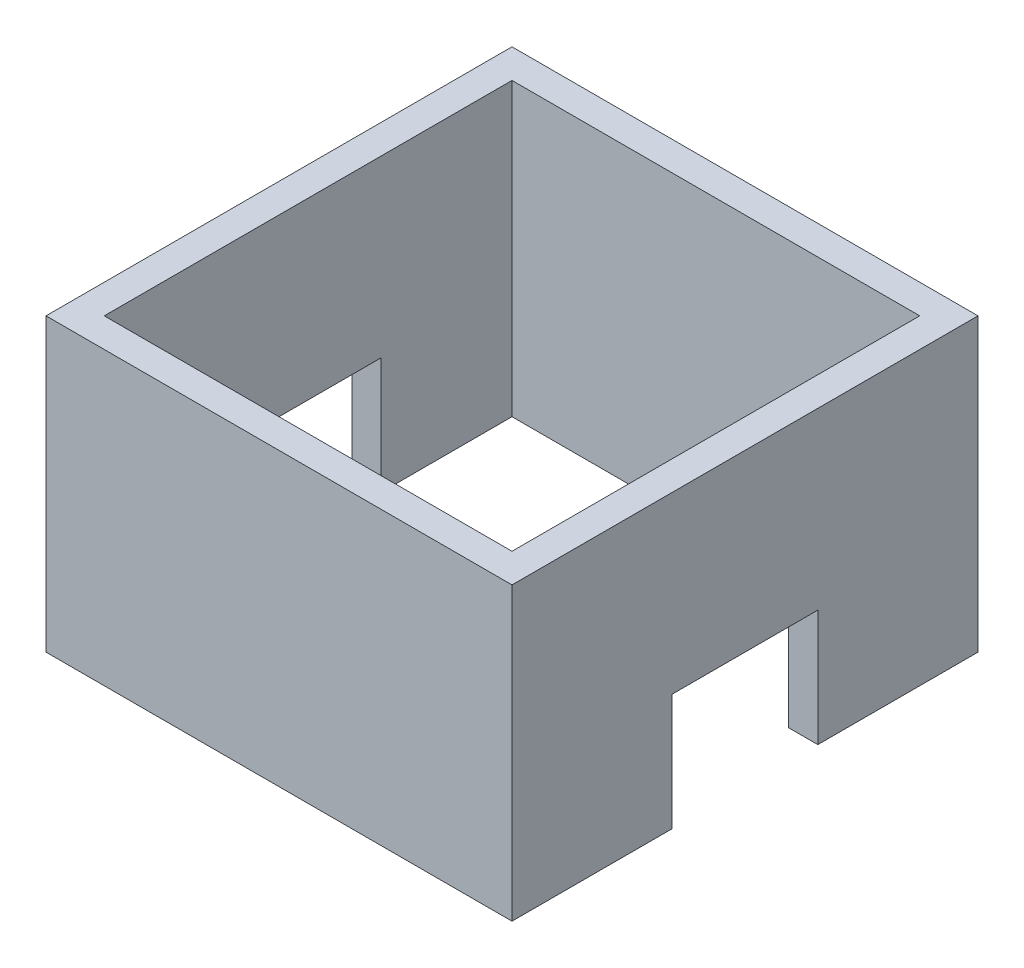
ISO-10303-21;
HEADER;
FILE_DESCRIPTION(('STEP AP214'),'2;1');
FILE_NAME('part.step','',(''),(''),'','','');
FILE_SCHEMA(('AUTOMOTIVE_DESIGN { 1 0 10303 214 1 1 1 1 }'));
ENDSEC;
DATA;
#1=APPLICATION_CONTEXT('core data for automotive mechanical design processes');
#2=APPLICATION_PROTOCOL_DEFINITION('international standard','automotive_design',2000,#1);
#3=PRODUCT_CONTEXT('',#1,'mechanical');
#4=PRODUCT('Part','Part','',(#3));
#5=PRODUCT_RELATED_PRODUCT_CATEGORY('part','',(#4));
#6=PRODUCT_DEFINITION_FORMATION('','',#4);
#7=PRODUCT_DEFINITION_CONTEXT('part definition',#1,'design');
#8=PRODUCT_DEFINITION('design','',#6,#7);
#9=PRODUCT_DEFINITION_SHAPE('','',#8);
#10=(LENGTH_UNIT() NAMED_UNIT(*) SI_UNIT(.MILLI.,.METRE.));
#11=(NAMED_UNIT(*) PLANE_ANGLE_UNIT() SI_UNIT($,.RADIAN.));
#12=(NAMED_UNIT(*) SI_UNIT($,.STERADIAN.) SOLID_ANGLE_UNIT());
#13=UNCERTAINTY_MEASURE_WITH_UNIT(LENGTH_MEASURE(1.E-05),#10,'distance_accuracy_value','');
#14=(GEOMETRIC_REPRESENTATION_CONTEXT(3) GLOBAL_UNCERTAINTY_ASSIGNED_CONTEXT((#13)) GLOBAL_UNIT_ASSIGNED_CONTEXT((#10,
#11,#12)) REPRESENTATION_CONTEXT('',''));
#15=CARTESIAN_POINT('',(0.,0.,0.));
#16=DIRECTION('',(0.,0.,1.));
#17=DIRECTION('',(1.,0.,0.));
#18=AXIS2_PLACEMENT_3D('',#15,#16,#17);
#19=CARTESIAN_POINT('',(0.,0.,0.));
#20=DIRECTION('',(0.,-1.,0.));
#21=DIRECTION('',(0.,0.,-1.));
#22=AXIS2_PLACEMENT_3D('',#19,#20,#21);
#23=PLANE('',#22);
#24=DIRECTION('',(1.,0.,0.));
#25=VECTOR('',#24,1.);
#26=CARTESIAN_POINT('',(-16.,0.,5.));
#27=LINE('',#26,#25);
#28=CARTESIAN_POINT('',(14.,0.,5.));
#29=VERTEX_POINT('',#28);
#30=CARTESIAN_POINT('',(16.,0.,5.));
#31=VERTEX_POINT('',#30);
#32=EDGE_CURVE('E157',#29,#31,#27,.T.);
#33=ORIENTED_EDGE('',*,*,#32,.T.);
#34=DIRECTION('',(0.,0.,-1.));
#35=VECTOR('',#34,1.);
#36=CARTESIAN_POINT('',(16.,0.,16.));
#37=LINE('',#36,#35);
#38=CARTESIAN_POINT('',(16.,0.,16.));
#39=VERTEX_POINT('',#38);
#40=EDGE_CURVE('E179',#39,#31,#37,.T.);
#41=ORIENTED_EDGE('',*,*,#40,.F.);
#42=DIRECTION('',(1.,0.,0.));
#43=VECTOR('',#42,1.);
#44=CARTESIAN_POINT('',(16.,0.,16.));
#45=LINE('',#44,#43);
#46=CARTESIAN_POINT('',(-16.,0.,16.));
#47=VERTEX_POINT('',#46);
#48=EDGE_CURVE('E173',#47,#39,#45,.T.);
#49=ORIENTED_EDGE('',*,*,#48,.F.);
#50=DIRECTION('',(0.,0.,1.));
#51=VECTOR('',#50,1.);
#52=CARTESIAN_POINT('',(-16.,0.,16.));
#53=LINE('',#52,#51);
#54=CARTESIAN_POINT('',(-16.,0.,5.));
#55=VERTEX_POINT('',#54);
#56=EDGE_CURVE('E162',#55,#47,#53,.T.);
#57=ORIENTED_EDGE('',*,*,#56,.F.);
#58=CARTESIAN_POINT('',(-14.,0.,5.));
#59=VERTEX_POINT('',#58);
#60=EDGE_CURVE('E145',#55,#59,#27,.T.);
#61=ORIENTED_EDGE('',*,*,#60,.T.);
#62=DIRECTION('',(0.,0.,1.));
#63=VECTOR('',#62,1.);
#64=CARTESIAN_POINT('',(-14.,0.,14.));
#65=LINE('',#64,#63);
#66=CARTESIAN_POINT('',(-14.,0.,14.));
#67=VERTEX_POINT('',#66);
#68=EDGE_CURVE('E229',#59,#67,#65,.T.);
#69=ORIENTED_EDGE('',*,*,#68,.T.);
#70=DIRECTION('',(1.,0.,0.));
#71=VECTOR('',#70,1.);
#72=CARTESIAN_POINT('',(14.,0.,14.));
#73=LINE('',#72,#71);
#74=CARTESIAN_POINT('',(14.,0.,14.));
#75=VERTEX_POINT('',#74);
#76=EDGE_CURVE('E244',#67,#75,#73,.T.);
#77=ORIENTED_EDGE('',*,*,#76,.T.);
#78=DIRECTION('',(0.,0.,-1.));
#79=VECTOR('',#78,1.);
#80=CARTESIAN_POINT('',(14.,0.,14.));
#81=LINE('',#80,#79);
#82=EDGE_CURVE('E247',#75,#29,#81,.T.);
#83=ORIENTED_EDGE('',*,*,#82,.T.);
#84=EDGE_LOOP('',(#33,#41,#49,#57,#61,#69,#77,#83));
#85=FACE_BOUND('',#84,.T.);
#86=ADVANCED_FACE('F33',(#85),#23,.T.);
#87=CARTESIAN_POINT('',(0.,20.,0.));
#88=DIRECTION('',(0.,-1.,0.));
#89=DIRECTION('',(0.,0.,-1.));
#90=AXIS2_PLACEMENT_3D('',#87,#88,#89);
#91=PLANE('',#90);
#92=DIRECTION('',(1.,0.,0.));
#93=VECTOR('',#92,1.);
#94=CARTESIAN_POINT('',(16.,20.,16.));
#95=LINE('',#94,#93);
#96=CARTESIAN_POINT('',(-16.,20.,16.));
#97=VERTEX_POINT('',#96);
#98=CARTESIAN_POINT('',(16.,20.,16.));
#99=VERTEX_POINT('',#98);
#100=EDGE_CURVE('E178',#97,#99,#95,.T.);
#101=ORIENTED_EDGE('',*,*,#100,.T.);
#102=DIRECTION('',(0.,0.,-1.));
#103=VECTOR('',#102,1.);
#104=CARTESIAN_POINT('',(16.,20.,16.));
#105=LINE('',#104,#103);
#106=CARTESIAN_POINT('',(16.,20.,-16.));
#107=VERTEX_POINT('',#106);
#108=EDGE_CURVE('E262',#99,#107,#105,.T.);
#109=ORIENTED_EDGE('',*,*,#108,.T.);
#110=DIRECTION('',(-1.,0.,0.));
#111=VECTOR('',#110,1.);
#112=CARTESIAN_POINT('',(16.,20.,-16.));
#113=LINE('',#112,#111);
#114=CARTESIAN_POINT('',(-16.,20.,-16.));
#115=VERTEX_POINT('',#114);
#116=EDGE_CURVE('E264',#107,#115,#113,.T.);
#117=ORIENTED_EDGE('',*,*,#116,.T.);
#118=DIRECTION('',(0.,0.,1.));
#119=VECTOR('',#118,1.);
#120=CARTESIAN_POINT('',(-16.,20.,16.));
#121=LINE('',#120,#119);
#122=EDGE_CURVE('E186',#115,#97,#121,.T.);
#123=ORIENTED_EDGE('',*,*,#122,.T.);
#124=EDGE_LOOP('',(#101,#109,#117,#123));
#125=FACE_BOUND('',#124,.T.);
#126=DIRECTION('',(0.,0.,1.));
#127=VECTOR('',#126,1.);
#128=CARTESIAN_POINT('',(-14.,20.,14.));
#129=LINE('',#128,#127);
#130=CARTESIAN_POINT('',(-14.,20.,-14.));
#131=VERTEX_POINT('',#130);
#132=CARTESIAN_POINT('',(-14.,20.,14.));
#133=VERTEX_POINT('',#132);
#134=EDGE_CURVE('E230',#131,#133,#129,.T.);
#135=ORIENTED_EDGE('',*,*,#134,.F.);
#136=DIRECTION('',(-1.,0.,0.));
#137=VECTOR('',#136,1.);
#138=CARTESIAN_POINT('',(14.,20.,-14.));
#139=LINE('',#138,#137);
#140=CARTESIAN_POINT('',(14.,20.,-14.));
#141=VERTEX_POINT('',#140);
#142=EDGE_CURVE('E238',#141,#131,#139,.T.);
#143=ORIENTED_EDGE('',*,*,#142,.F.);
#144=DIRECTION('',(0.,0.,-1.));
#145=VECTOR('',#144,1.);
#146=CARTESIAN_POINT('',(14.,20.,14.));
#147=LINE('',#146,#145);
#148=CARTESIAN_POINT('',(14.,20.,14.));
#149=VERTEX_POINT('',#148);
#150=EDGE_CURVE('E235',#149,#141,#147,.T.);
#151=ORIENTED_EDGE('',*,*,#150,.F.);
#152=DIRECTION('',(1.,0.,0.));
#153=VECTOR('',#152,1.);
#154=CARTESIAN_POINT('',(14.,20.,14.));
#155=LINE('',#154,#153);
#156=EDGE_CURVE('E232',#133,#149,#155,.T.);
#157=ORIENTED_EDGE('',*,*,#156,.F.);
#158=EDGE_LOOP('',(#135,#143,#151,#157));
#159=FACE_BOUND('',#158,.T.);
#160=ADVANCED_FACE('F282',(#125,#159),#91,.F.);
#161=DIRECTION('',(1.,0.,0.));
#162=VECTOR('',#161,1.);
#163=CARTESIAN_POINT('',(-16.,0.,-5.00000000000001));
#164=LINE('',#163,#162);
#165=CARTESIAN_POINT('',(-16.,0.,-5.00000000000001));
#166=VERTEX_POINT('',#165);
#167=CARTESIAN_POINT('',(-14.,0.,-5.));
#168=VERTEX_POINT('',#167);
#169=EDGE_CURVE('E48',#166,#168,#164,.T.);
#170=ORIENTED_EDGE('',*,*,#169,.F.);
#171=CARTESIAN_POINT('',(-16.,0.,-16.));
#172=VERTEX_POINT('',#171);
#173=EDGE_CURVE('E174',#172,#166,#53,.T.);
#174=ORIENTED_EDGE('',*,*,#173,.F.);
#175=DIRECTION('',(-1.,0.,0.));
#176=VECTOR('',#175,1.);
#177=CARTESIAN_POINT('',(16.,0.,-16.));
#178=LINE('',#177,#176);
#179=CARTESIAN_POINT('',(16.,0.,-16.));
#180=VERTEX_POINT('',#179);
#181=EDGE_CURVE('E175',#180,#172,#178,.T.);
#182=ORIENTED_EDGE('',*,*,#181,.F.);
#183=CARTESIAN_POINT('',(16.,0.,-5.00000000000001));
#184=VERTEX_POINT('',#183);
#185=EDGE_CURVE('E217',#184,#180,#37,.T.);
#186=ORIENTED_EDGE('',*,*,#185,.F.);
#187=CARTESIAN_POINT('',(14.,0.,-5.00000000000001));
#188=VERTEX_POINT('',#187);
#189=EDGE_CURVE('E156',#188,#184,#164,.T.);
#190=ORIENTED_EDGE('',*,*,#189,.F.);
#191=CARTESIAN_POINT('',(14.,0.,-14.));
#192=VERTEX_POINT('',#191);
#193=EDGE_CURVE('E208',#188,#192,#81,.T.);
#194=ORIENTED_EDGE('',*,*,#193,.T.);
#195=DIRECTION('',(-1.,0.,0.));
#196=VECTOR('',#195,1.);
#197=CARTESIAN_POINT('',(14.,0.,-14.));
#198=LINE('',#197,#196);
#199=CARTESIAN_POINT('',(-14.,0.,-14.));
#200=VERTEX_POINT('',#199);
#201=EDGE_CURVE('E233',#192,#200,#198,.T.);
#202=ORIENTED_EDGE('',*,*,#201,.T.);
#203=EDGE_CURVE('E241',#200,#168,#65,.T.);
#204=ORIENTED_EDGE('',*,*,#203,.T.);
#205=EDGE_LOOP('',(#170,#174,#182,#186,#190,#194,#202,#204));
#206=FACE_BOUND('',#205,.T.);
#207=ADVANCED_FACE('F214',(#206),#23,.T.);
#208=CARTESIAN_POINT('',(16.,20.,16.));
#209=DIRECTION('',(0.,0.,-1.));
#210=DIRECTION('',(-1.,0.,0.));
#211=AXIS2_PLACEMENT_3D('',#208,#209,#210);
#212=PLANE('',#211);
#213=ORIENTED_EDGE('',*,*,#48,.T.);
#214=DIRECTION('',(0.,-1.,0.));
#215=VECTOR('',#214,1.);
#216=CARTESIAN_POINT('',(16.,20.,16.));
#217=LINE('',#216,#215);
#218=EDGE_CURVE('E192',#99,#39,#217,.T.);
#219=ORIENTED_EDGE('',*,*,#218,.F.);
#220=ORIENTED_EDGE('',*,*,#100,.F.);
#221=DIRECTION('',(0.,-1.,0.));
#222=VECTOR('',#221,1.);
#223=CARTESIAN_POINT('',(-16.,20.,16.));
#224=LINE('',#223,#222);
#225=EDGE_CURVE('E183',#97,#47,#224,.T.);
#226=ORIENTED_EDGE('',*,*,#225,.T.);
#227=EDGE_LOOP('',(#213,#219,#220,#226));
#228=FACE_BOUND('',#227,.T.);
#229=ADVANCED_FACE('F35',(#228),#212,.F.);
#230=CARTESIAN_POINT('',(16.,20.,16.));
#231=DIRECTION('',(-1.,0.,0.));
#232=DIRECTION('',(0.,0.,1.));
#233=AXIS2_PLACEMENT_3D('',#230,#231,#232);
#234=PLANE('',#233);
#235=ORIENTED_EDGE('',*,*,#40,.T.);
#236=DIRECTION('',(0.,-1.,0.));
#237=VECTOR('',#236,1.);
#238=CARTESIAN_POINT('',(16.,8.,5.));
#239=LINE('',#238,#237);
#240=CARTESIAN_POINT('',(16.,8.,5.));
#241=VERTEX_POINT('',#240);
#242=EDGE_CURVE('E438',#241,#31,#239,.T.);
#243=ORIENTED_EDGE('',*,*,#242,.F.);
#244=DIRECTION('',(0.,0.,1.));
#245=VECTOR('',#244,1.);
#246=CARTESIAN_POINT('',(16.,8.,-5.));
#247=LINE('',#246,#245);
#248=CARTESIAN_POINT('',(16.,8.,-5.));
#249=VERTEX_POINT('',#248);
#250=EDGE_CURVE('E168',#249,#241,#247,.T.);
#251=ORIENTED_EDGE('',*,*,#250,.F.);
#252=DIRECTION('',(0.,1.,0.));
#253=VECTOR('',#252,1.);
#254=CARTESIAN_POINT('',(16.,8.,-5.));
#255=LINE('',#254,#253);
#256=EDGE_CURVE('E274',#184,#249,#255,.T.);
#257=ORIENTED_EDGE('',*,*,#256,.F.);
#258=ORIENTED_EDGE('',*,*,#185,.T.);
#259=DIRECTION('',(0.,-1.,0.));
#260=VECTOR('',#259,1.);
#261=CARTESIAN_POINT('',(16.,20.,-16.));
#262=LINE('',#261,#260);
#263=EDGE_CURVE('E189',#107,#180,#262,.T.);
#264=ORIENTED_EDGE('',*,*,#263,.F.);
#265=ORIENTED_EDGE('',*,*,#108,.F.);
#266=ORIENTED_EDGE('',*,*,#218,.T.);
#267=EDGE_LOOP('',(#235,#243,#251,#257,#258,#264,#265,#266));
#268=FACE_BOUND('',#267,.T.);
#269=ADVANCED_FACE('F271',(#268),#234,.F.);
#270=CARTESIAN_POINT('',(16.,20.,-16.));
#271=DIRECTION('',(0.,0.,1.));
#272=DIRECTION('',(1.,0.,0.));
#273=AXIS2_PLACEMENT_3D('',#270,#271,#272);
#274=PLANE('',#273);
#275=ORIENTED_EDGE('',*,*,#181,.T.);
#276=DIRECTION('',(0.,-1.,0.));
#277=VECTOR('',#276,1.);
#278=CARTESIAN_POINT('',(-16.,20.,-16.));
#279=LINE('',#278,#277);
#280=EDGE_CURVE('E185',#115,#172,#279,.T.);
#281=ORIENTED_EDGE('',*,*,#280,.F.);
#282=ORIENTED_EDGE('',*,*,#116,.F.);
#283=ORIENTED_EDGE('',*,*,#263,.T.);
#284=EDGE_LOOP('',(#275,#281,#282,#283));
#285=FACE_BOUND('',#284,.T.);
#286=ADVANCED_FACE('F276',(#285),#274,.F.);
#287=CARTESIAN_POINT('',(-16.,20.,16.));
#288=DIRECTION('',(1.,0.,0.));
#289=DIRECTION('',(0.,0.,-1.));
#290=AXIS2_PLACEMENT_3D('',#287,#288,#289);
#291=PLANE('',#290);
#292=DIRECTION('',(0.,0.,1.));
#293=VECTOR('',#292,1.);
#294=CARTESIAN_POINT('',(-16.,8.,-5.));
#295=LINE('',#294,#293);
#296=CARTESIAN_POINT('',(-16.,8.,-5.));
#297=VERTEX_POINT('',#296);
#298=CARTESIAN_POINT('',(-16.,8.,5.));
#299=VERTEX_POINT('',#298);
#300=EDGE_CURVE('E166',#297,#299,#295,.T.);
#301=ORIENTED_EDGE('',*,*,#300,.T.);
#302=DIRECTION('',(0.,-1.,0.));
#303=VECTOR('',#302,1.);
#304=CARTESIAN_POINT('',(-16.,8.,5.));
#305=LINE('',#304,#303);
#306=EDGE_CURVE('E149',#299,#55,#305,.T.);
#307=ORIENTED_EDGE('',*,*,#306,.T.);
#308=ORIENTED_EDGE('',*,*,#56,.T.);
#309=ORIENTED_EDGE('',*,*,#225,.F.);
#310=ORIENTED_EDGE('',*,*,#122,.F.);
#311=ORIENTED_EDGE('',*,*,#280,.T.);
#312=ORIENTED_EDGE('',*,*,#173,.T.);
#313=DIRECTION('',(0.,1.,0.));
#314=VECTOR('',#313,1.);
#315=CARTESIAN_POINT('',(-16.,8.,-5.));
#316=LINE('',#315,#314);
#317=EDGE_CURVE('E167',#166,#297,#316,.T.);
#318=ORIENTED_EDGE('',*,*,#317,.T.);
#319=EDGE_LOOP('',(#301,#307,#308,#309,#310,#311,#312,#318));
#320=FACE_BOUND('',#319,.T.);
#321=ADVANCED_FACE('F160',(#320),#291,.F.);
#322=CARTESIAN_POINT('',(-14.,20.,14.));
#323=DIRECTION('',(1.,0.,0.));
#324=DIRECTION('',(0.,0.,-1.));
#325=AXIS2_PLACEMENT_3D('',#322,#323,#324);
#326=PLANE('',#325);
#327=DIRECTION('',(0.,-1.,0.));
#328=VECTOR('',#327,1.);
#329=CARTESIAN_POINT('',(-14.,20.,5.));
#330=LINE('',#329,#328);
#331=CARTESIAN_POINT('',(-14.,8.,5.));
#332=VERTEX_POINT('',#331);
#333=EDGE_CURVE('E152',#332,#59,#330,.T.);
#334=ORIENTED_EDGE('',*,*,#333,.F.);
#335=DIRECTION('',(0.,0.,1.));
#336=VECTOR('',#335,1.);
#337=CARTESIAN_POINT('',(-14.,8.,14.));
#338=LINE('',#337,#336);
#339=CARTESIAN_POINT('',(-14.,8.,-5.));
#340=VERTEX_POINT('',#339);
#341=EDGE_CURVE('E225',#340,#332,#338,.T.);
#342=ORIENTED_EDGE('',*,*,#341,.F.);
#343=DIRECTION('',(0.,1.,0.));
#344=VECTOR('',#343,1.);
#345=CARTESIAN_POINT('',(-14.,20.,-4.99999999999999));
#346=LINE('',#345,#344);
#347=EDGE_CURVE('E223',#168,#340,#346,.T.);
#348=ORIENTED_EDGE('',*,*,#347,.F.);
#349=ORIENTED_EDGE('',*,*,#203,.F.);
#350=DIRECTION('',(0.,-1.,0.));
#351=VECTOR('',#350,1.);
#352=CARTESIAN_POINT('',(-14.,20.,-14.));
#353=LINE('',#352,#351);
#354=EDGE_CURVE('E240',#131,#200,#353,.T.);
#355=ORIENTED_EDGE('',*,*,#354,.F.);
#356=ORIENTED_EDGE('',*,*,#134,.T.);
#357=DIRECTION('',(0.,-1.,0.));
#358=VECTOR('',#357,1.);
#359=CARTESIAN_POINT('',(-14.,20.,14.));
#360=LINE('',#359,#358);
#361=EDGE_CURVE('E257',#133,#67,#360,.T.);
#362=ORIENTED_EDGE('',*,*,#361,.T.);
#363=ORIENTED_EDGE('',*,*,#68,.F.);
#364=EDGE_LOOP('',(#334,#342,#348,#349,#355,#356,#362,#363));
#365=FACE_BOUND('',#364,.T.);
#366=ADVANCED_FACE('F301',(#365),#326,.T.);
#367=CARTESIAN_POINT('',(14.,20.,14.));
#368=DIRECTION('',(0.,0.,-1.));
#369=DIRECTION('',(-1.,0.,0.));
#370=AXIS2_PLACEMENT_3D('',#367,#368,#369);
#371=PLANE('',#370);
#372=ORIENTED_EDGE('',*,*,#76,.F.);
#373=ORIENTED_EDGE('',*,*,#361,.F.);
#374=ORIENTED_EDGE('',*,*,#156,.T.);
#375=DIRECTION('',(0.,-1.,0.));
#376=VECTOR('',#375,1.);
#377=CARTESIAN_POINT('',(14.,20.,14.));
#378=LINE('',#377,#376);
#379=EDGE_CURVE('E255',#149,#75,#378,.T.);
#380=ORIENTED_EDGE('',*,*,#379,.T.);
#381=EDGE_LOOP('',(#372,#373,#374,#380));
#382=FACE_BOUND('',#381,.T.);
#383=ADVANCED_FACE('F318',(#382),#371,.T.);
#384=CARTESIAN_POINT('',(14.,20.,14.));
#385=DIRECTION('',(-1.,0.,0.));
#386=DIRECTION('',(0.,0.,1.));
#387=AXIS2_PLACEMENT_3D('',#384,#385,#386);
#388=PLANE('',#387);
#389=DIRECTION('',(0.,1.,0.));
#390=VECTOR('',#389,1.);
#391=CARTESIAN_POINT('',(14.,20.,5.));
#392=LINE('',#391,#390);
#393=CARTESIAN_POINT('',(14.,8.,5.));
#394=VERTEX_POINT('',#393);
#395=EDGE_CURVE('E11',#29,#394,#392,.T.);
#396=ORIENTED_EDGE('',*,*,#395,.F.);
#397=ORIENTED_EDGE('',*,*,#82,.F.);
#398=ORIENTED_EDGE('',*,*,#379,.F.);
#399=ORIENTED_EDGE('',*,*,#150,.T.);
#400=DIRECTION('',(0.,-1.,0.));
#401=VECTOR('',#400,1.);
#402=CARTESIAN_POINT('',(14.,20.,-14.));
#403=LINE('',#402,#401);
#404=EDGE_CURVE('E253',#141,#192,#403,.T.);
#405=ORIENTED_EDGE('',*,*,#404,.T.);
#406=ORIENTED_EDGE('',*,*,#193,.F.);
#407=DIRECTION('',(0.,-1.,0.));
#408=VECTOR('',#407,1.);
#409=CARTESIAN_POINT('',(14.,20.,-4.99999999999999));
#410=LINE('',#409,#408);
#411=CARTESIAN_POINT('',(14.,8.,-5.));
#412=VERTEX_POINT('',#411);
#413=EDGE_CURVE('E195',#412,#188,#410,.T.);
#414=ORIENTED_EDGE('',*,*,#413,.F.);
#415=DIRECTION('',(0.,0.,-1.));
#416=VECTOR('',#415,1.);
#417=CARTESIAN_POINT('',(14.,8.,14.));
#418=LINE('',#417,#416);
#419=EDGE_CURVE('E41',#394,#412,#418,.T.);
#420=ORIENTED_EDGE('',*,*,#419,.F.);
#421=EDGE_LOOP('',(#396,#397,#398,#399,#405,#406,#414,#420));
#422=FACE_BOUND('',#421,.T.);
#423=ADVANCED_FACE('F206',(#422),#388,.T.);
#424=CARTESIAN_POINT('',(14.,20.,-14.));
#425=DIRECTION('',(0.,0.,1.));
#426=DIRECTION('',(1.,0.,0.));
#427=AXIS2_PLACEMENT_3D('',#424,#425,#426);
#428=PLANE('',#427);
#429=ORIENTED_EDGE('',*,*,#201,.F.);
#430=ORIENTED_EDGE('',*,*,#404,.F.);
#431=ORIENTED_EDGE('',*,*,#142,.T.);
#432=ORIENTED_EDGE('',*,*,#354,.T.);
#433=EDGE_LOOP('',(#429,#430,#431,#432));
#434=FACE_BOUND('',#433,.T.);
#435=ADVANCED_FACE('F332',(#434),#428,.T.);
#436=CARTESIAN_POINT('',(-16.,8.,-5.));
#437=DIRECTION('',(0.,0.,-1.));
#438=DIRECTION('',(0.,1.,0.));
#439=AXIS2_PLACEMENT_3D('',#436,#437,#438);
#440=PLANE('',#439);
#441=ORIENTED_EDGE('',*,*,#413,.T.);
#442=ORIENTED_EDGE('',*,*,#189,.T.);
#443=ORIENTED_EDGE('',*,*,#256,.T.);
#444=DIRECTION('',(1.,0.,0.));
#445=VECTOR('',#444,1.);
#446=CARTESIAN_POINT('',(-16.,8.,-5.));
#447=LINE('',#446,#445);
#448=EDGE_CURVE('E56',#412,#249,#447,.T.);
#449=ORIENTED_EDGE('',*,*,#448,.F.);
#450=EDGE_LOOP('',(#441,#442,#443,#449));
#451=FACE_BOUND('',#450,.T.);
#452=ADVANCED_FACE('F210',(#451),#440,.F.);
#453=CARTESIAN_POINT('',(-16.,8.,-5.));
#454=DIRECTION('',(0.,1.,0.));
#455=DIRECTION('',(0.,0.,1.));
#456=AXIS2_PLACEMENT_3D('',#453,#454,#455);
#457=PLANE('',#456);
#458=ORIENTED_EDGE('',*,*,#419,.T.);
#459=ORIENTED_EDGE('',*,*,#448,.T.);
#460=ORIENTED_EDGE('',*,*,#250,.T.);
#461=DIRECTION('',(1.,0.,0.));
#462=VECTOR('',#461,1.);
#463=CARTESIAN_POINT('',(-16.,8.,5.));
#464=LINE('',#463,#462);
#465=EDGE_CURVE('E202',#394,#241,#464,.T.);
#466=ORIENTED_EDGE('',*,*,#465,.F.);
#467=EDGE_LOOP('',(#458,#459,#460,#466));
#468=FACE_BOUND('',#467,.T.);
#469=ADVANCED_FACE('F200',(#468),#457,.F.);
#470=CARTESIAN_POINT('',(-16.,8.,5.));
#471=DIRECTION('',(0.,0.,1.));
#472=DIRECTION('',(0.,-1.,0.));
#473=AXIS2_PLACEMENT_3D('',#470,#471,#472);
#474=PLANE('',#473);
#475=ORIENTED_EDGE('',*,*,#395,.T.);
#476=ORIENTED_EDGE('',*,*,#465,.T.);
#477=ORIENTED_EDGE('',*,*,#242,.T.);
#478=ORIENTED_EDGE('',*,*,#32,.F.);
#479=EDGE_LOOP('',(#475,#476,#477,#478));
#480=FACE_BOUND('',#479,.T.);
#481=ADVANCED_FACE('F352',(#480),#474,.F.);
#482=ORIENTED_EDGE('',*,*,#333,.T.);
#483=ORIENTED_EDGE('',*,*,#60,.F.);
#484=ORIENTED_EDGE('',*,*,#306,.F.);
#485=EDGE_CURVE('E226',#299,#332,#464,.T.);
#486=ORIENTED_EDGE('',*,*,#485,.T.);
#487=EDGE_LOOP('',(#482,#483,#484,#486));
#488=FACE_BOUND('',#487,.T.);
#489=ADVANCED_FACE('F147',(#488),#474,.F.);
#490=ORIENTED_EDGE('',*,*,#341,.T.);
#491=ORIENTED_EDGE('',*,*,#485,.F.);
#492=ORIENTED_EDGE('',*,*,#300,.F.);
#493=EDGE_CURVE('E220',#297,#340,#447,.T.);
#494=ORIENTED_EDGE('',*,*,#493,.T.);
#495=EDGE_LOOP('',(#490,#491,#492,#494));
#496=FACE_BOUND('',#495,.T.);
#497=ADVANCED_FACE('F354',(#496),#457,.F.);
#498=ORIENTED_EDGE('',*,*,#347,.T.);
#499=ORIENTED_EDGE('',*,*,#493,.F.);
#500=ORIENTED_EDGE('',*,*,#317,.F.);
#501=ORIENTED_EDGE('',*,*,#169,.T.);
#502=EDGE_LOOP('',(#498,#499,#500,#501));
#503=FACE_BOUND('',#502,.T.);
#504=ADVANCED_FACE('F346',(#503),#440,.F.);
#505=CLOSED_SHELL('',(#86,#160,#207,#229,#269,#286,#321,#366,#383,#423,#435,#452,#469,#481,#489,
#497,#504));
#506=MANIFOLD_SOLID_BREP('B2',#505);
#507=ADVANCED_BREP_SHAPE_REPRESENTATION('',(#18,#506),#14);
#508=SHAPE_DEFINITION_REPRESENTATION(#9,#507);
ENDSEC;
END-ISO-10303-21;
